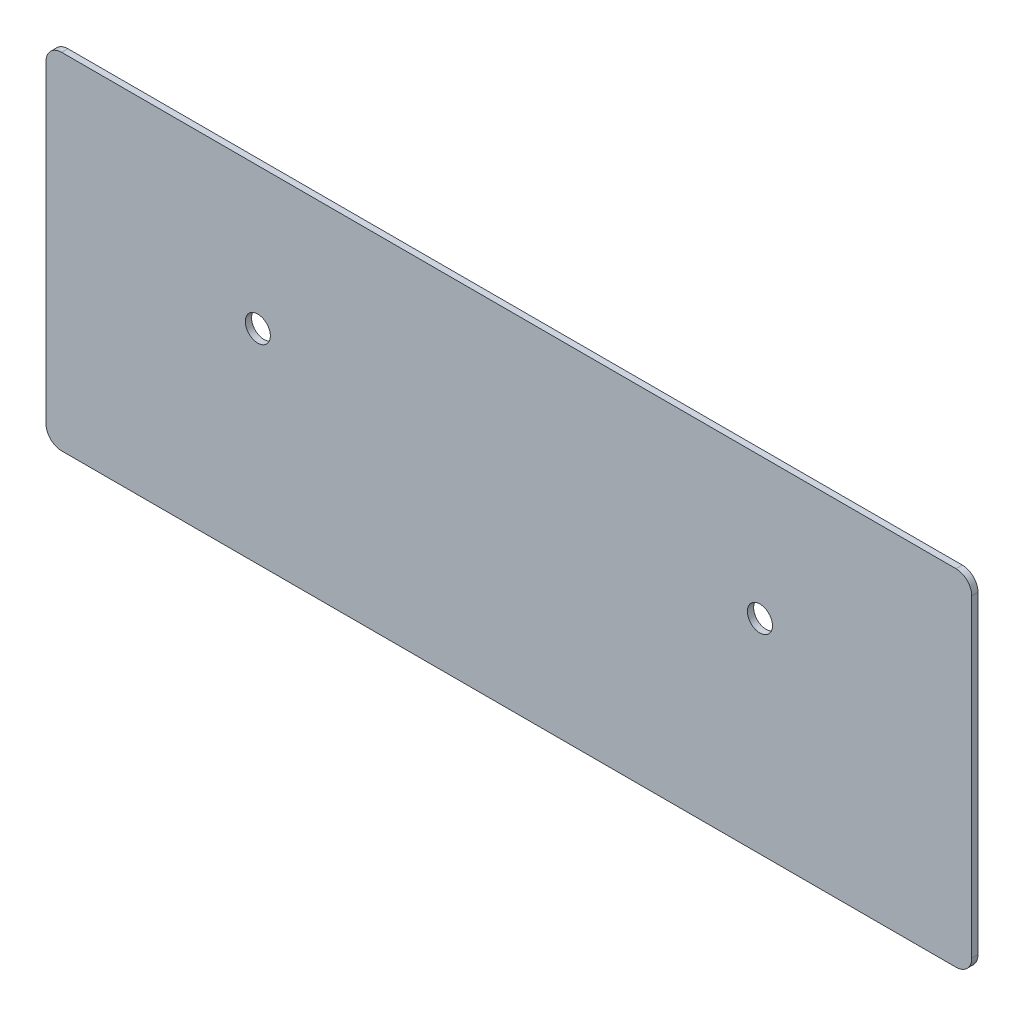
ISO-10303-21;
HEADER;
FILE_DESCRIPTION(('STEP AP214'),'2;1');
FILE_NAME('part.step','',(''),(''),'','','');
FILE_SCHEMA(('AUTOMOTIVE_DESIGN { 1 0 10303 214 1 1 1 1 }'));
ENDSEC;
DATA;
#1=APPLICATION_CONTEXT('core data for automotive mechanical design processes');
#2=APPLICATION_PROTOCOL_DEFINITION('international standard','automotive_design',2000,#1);
#3=PRODUCT_CONTEXT('',#1,'mechanical');
#4=PRODUCT('Part','Part','',(#3));
#5=PRODUCT_RELATED_PRODUCT_CATEGORY('part','',(#4));
#6=PRODUCT_DEFINITION_FORMATION('','',#4);
#7=PRODUCT_DEFINITION_CONTEXT('part definition',#1,'design');
#8=PRODUCT_DEFINITION('design','',#6,#7);
#9=PRODUCT_DEFINITION_SHAPE('','',#8);
#10=(LENGTH_UNIT() NAMED_UNIT(*) SI_UNIT(.MILLI.,.METRE.));
#11=(NAMED_UNIT(*) PLANE_ANGLE_UNIT() SI_UNIT($,.RADIAN.));
#12=(NAMED_UNIT(*) SI_UNIT($,.STERADIAN.) SOLID_ANGLE_UNIT());
#13=UNCERTAINTY_MEASURE_WITH_UNIT(LENGTH_MEASURE(1.E-05),#10,'distance_accuracy_value','');
#14=(GEOMETRIC_REPRESENTATION_CONTEXT(3) GLOBAL_UNCERTAINTY_ASSIGNED_CONTEXT((#13)) GLOBAL_UNIT_ASSIGNED_CONTEXT((#10,
#11,#12)) REPRESENTATION_CONTEXT('',''));
#15=CARTESIAN_POINT('',(0.,0.,0.));
#16=DIRECTION('',(0.,0.,1.));
#17=DIRECTION('',(1.,0.,0.));
#18=AXIS2_PLACEMENT_3D('',#15,#16,#17);
#19=CARTESIAN_POINT('',(-147.5,55.,0.));
#20=DIRECTION('',(0.,-1.,0.));
#21=DIRECTION('',(-1.,0.,0.));
#22=AXIS2_PLACEMENT_3D('',#19,#20,#21);
#23=PLANE('',#22);
#24=DIRECTION('',(0.,0.,1.));
#25=VECTOR('',#24,1.);
#26=CARTESIAN_POINT('',(142.5,55.,0.));
#27=LINE('',#26,#25);
#28=CARTESIAN_POINT('',(142.5,55.,-2.));
#29=VERTEX_POINT('',#28);
#30=CARTESIAN_POINT('',(142.5,55.,0.));
#31=VERTEX_POINT('',#30);
#32=EDGE_CURVE('E11',#29,#31,#27,.T.);
#33=ORIENTED_EDGE('',*,*,#32,.F.);
#34=DIRECTION('',(-1.,0.,0.));
#35=VECTOR('',#34,1.);
#36=CARTESIAN_POINT('',(0.,55.,-2.));
#37=LINE('',#36,#35);
#38=CARTESIAN_POINT('',(-142.5,55.,-2.));
#39=VERTEX_POINT('',#38);
#40=EDGE_CURVE('E106',#29,#39,#37,.T.);
#41=ORIENTED_EDGE('',*,*,#40,.T.);
#42=DIRECTION('',(0.,0.,1.));
#43=VECTOR('',#42,1.);
#44=CARTESIAN_POINT('',(-142.5,55.,0.));
#45=LINE('',#44,#43);
#46=CARTESIAN_POINT('',(-142.5,55.,0.));
#47=VERTEX_POINT('',#46);
#48=EDGE_CURVE('E49',#39,#47,#45,.T.);
#49=ORIENTED_EDGE('',*,*,#48,.T.);
#50=DIRECTION('',(-1.,0.,0.));
#51=VECTOR('',#50,1.);
#52=CARTESIAN_POINT('',(-147.5,55.,0.));
#53=LINE('',#52,#51);
#54=EDGE_CURVE('E148',#31,#47,#53,.T.);
#55=ORIENTED_EDGE('',*,*,#54,.F.);
#56=EDGE_LOOP('',(#33,#41,#49,#55));
#57=FACE_BOUND('',#56,.T.);
#58=ADVANCED_FACE('F39',(#57),#23,.F.);
#59=CARTESIAN_POINT('',(-142.5,50.,0.));
#60=DIRECTION('',(0.,0.,-1.));
#61=DIRECTION('',(-1.,0.,0.));
#62=AXIS2_PLACEMENT_3D('',#59,#60,#61);
#63=CYLINDRICAL_SURFACE('',#62,5.);
#64=ORIENTED_EDGE('',*,*,#48,.F.);
#65=CARTESIAN_POINT('',(-142.5,50.,-2.));
#66=DIRECTION('',(0.,0.,-1.));
#67=DIRECTION('',(-1.,0.,0.));
#68=AXIS2_PLACEMENT_3D('',#65,#66,#67);
#69=CIRCLE('',#68,5.);
#70=CARTESIAN_POINT('',(-147.5,50.,-2.));
#71=VERTEX_POINT('',#70);
#72=EDGE_CURVE('E128',#39,#71,#69,.F.);
#73=ORIENTED_EDGE('',*,*,#72,.T.);
#74=DIRECTION('',(0.,0.,1.));
#75=VECTOR('',#74,1.);
#76=CARTESIAN_POINT('',(-147.5,50.,0.));
#77=LINE('',#76,#75);
#78=CARTESIAN_POINT('',(-147.5,50.,0.));
#79=VERTEX_POINT('',#78);
#80=EDGE_CURVE('E141',#71,#79,#77,.T.);
#81=ORIENTED_EDGE('',*,*,#80,.T.);
#82=CARTESIAN_POINT('',(-142.5,50.,0.));
#83=DIRECTION('',(0.,0.,-1.));
#84=DIRECTION('',(-1.,0.,0.));
#85=AXIS2_PLACEMENT_3D('',#82,#83,#84);
#86=CIRCLE('',#85,5.);
#87=EDGE_CURVE('E157',#47,#79,#86,.F.);
#88=ORIENTED_EDGE('',*,*,#87,.F.);
#89=EDGE_LOOP('',(#64,#73,#81,#88));
#90=FACE_BOUND('',#89,.T.);
#91=ADVANCED_FACE('F160',(#90),#63,.T.);
#92=CARTESIAN_POINT('',(-147.5,-55.,0.));
#93=DIRECTION('',(1.,0.,0.));
#94=DIRECTION('',(0.,-1.,0.));
#95=AXIS2_PLACEMENT_3D('',#92,#93,#94);
#96=PLANE('',#95);
#97=ORIENTED_EDGE('',*,*,#80,.F.);
#98=DIRECTION('',(0.,1.,0.));
#99=VECTOR('',#98,1.);
#100=CARTESIAN_POINT('',(-147.5,0.,-2.));
#101=LINE('',#100,#99);
#102=CARTESIAN_POINT('',(-147.5,-50.,-2.));
#103=VERTEX_POINT('',#102);
#104=EDGE_CURVE('E125',#71,#103,#101,.F.);
#105=ORIENTED_EDGE('',*,*,#104,.T.);
#106=DIRECTION('',(0.,0.,1.));
#107=VECTOR('',#106,1.);
#108=CARTESIAN_POINT('',(-147.5,-50.,0.));
#109=LINE('',#108,#107);
#110=CARTESIAN_POINT('',(-147.5,-50.,0.));
#111=VERTEX_POINT('',#110);
#112=EDGE_CURVE('E138',#103,#111,#109,.T.);
#113=ORIENTED_EDGE('',*,*,#112,.T.);
#114=DIRECTION('',(0.,-1.,0.));
#115=VECTOR('',#114,1.);
#116=CARTESIAN_POINT('',(-147.5,-55.,0.));
#117=LINE('',#116,#115);
#118=EDGE_CURVE('E161',#79,#111,#117,.T.);
#119=ORIENTED_EDGE('',*,*,#118,.F.);
#120=EDGE_LOOP('',(#97,#105,#113,#119));
#121=FACE_BOUND('',#120,.T.);
#122=ADVANCED_FACE('F199',(#121),#96,.F.);
#123=CARTESIAN_POINT('',(-142.5,-50.,0.));
#124=DIRECTION('',(0.,0.,-1.));
#125=DIRECTION('',(-1.,0.,0.));
#126=AXIS2_PLACEMENT_3D('',#123,#124,#125);
#127=CYLINDRICAL_SURFACE('',#126,5.);
#128=ORIENTED_EDGE('',*,*,#112,.F.);
#129=CARTESIAN_POINT('',(-142.5,-50.,-2.));
#130=DIRECTION('',(0.,0.,-1.));
#131=DIRECTION('',(-1.,0.,0.));
#132=AXIS2_PLACEMENT_3D('',#129,#130,#131);
#133=CIRCLE('',#132,5.);
#134=CARTESIAN_POINT('',(-142.5,-55.,-2.));
#135=VERTEX_POINT('',#134);
#136=EDGE_CURVE('E122',#103,#135,#133,.F.);
#137=ORIENTED_EDGE('',*,*,#136,.T.);
#138=DIRECTION('',(0.,0.,1.));
#139=VECTOR('',#138,1.);
#140=CARTESIAN_POINT('',(-142.5,-55.,0.));
#141=LINE('',#140,#139);
#142=CARTESIAN_POINT('',(-142.5,-55.,0.));
#143=VERTEX_POINT('',#142);
#144=EDGE_CURVE('E135',#135,#143,#141,.T.);
#145=ORIENTED_EDGE('',*,*,#144,.T.);
#146=CARTESIAN_POINT('',(-142.5,-50.,0.));
#147=DIRECTION('',(0.,0.,-1.));
#148=DIRECTION('',(-1.,0.,0.));
#149=AXIS2_PLACEMENT_3D('',#146,#147,#148);
#150=CIRCLE('',#149,5.);
#151=EDGE_CURVE('E163',#111,#143,#150,.F.);
#152=ORIENTED_EDGE('',*,*,#151,.F.);
#153=EDGE_LOOP('',(#128,#137,#145,#152));
#154=FACE_BOUND('',#153,.T.);
#155=ADVANCED_FACE('F204',(#154),#127,.T.);
#156=CARTESIAN_POINT('',(-147.5,-55.,0.));
#157=DIRECTION('',(0.,1.,0.));
#158=DIRECTION('',(1.,0.,0.));
#159=AXIS2_PLACEMENT_3D('',#156,#157,#158);
#160=PLANE('',#159);
#161=ORIENTED_EDGE('',*,*,#144,.F.);
#162=DIRECTION('',(-1.,0.,0.));
#163=VECTOR('',#162,1.);
#164=CARTESIAN_POINT('',(0.,-55.,-2.));
#165=LINE('',#164,#163);
#166=CARTESIAN_POINT('',(142.5,-55.,-2.));
#167=VERTEX_POINT('',#166);
#168=EDGE_CURVE('E119',#135,#167,#165,.F.);
#169=ORIENTED_EDGE('',*,*,#168,.T.);
#170=DIRECTION('',(0.,0.,1.));
#171=VECTOR('',#170,1.);
#172=CARTESIAN_POINT('',(142.5,-55.,0.));
#173=LINE('',#172,#171);
#174=CARTESIAN_POINT('',(142.5,-55.,0.));
#175=VERTEX_POINT('',#174);
#176=EDGE_CURVE('E133',#167,#175,#173,.T.);
#177=ORIENTED_EDGE('',*,*,#176,.T.);
#178=DIRECTION('',(1.,0.,0.));
#179=VECTOR('',#178,1.);
#180=CARTESIAN_POINT('',(-147.5,-55.,0.));
#181=LINE('',#180,#179);
#182=EDGE_CURVE('E169',#143,#175,#181,.T.);
#183=ORIENTED_EDGE('',*,*,#182,.F.);
#184=EDGE_LOOP('',(#161,#169,#177,#183));
#185=FACE_BOUND('',#184,.T.);
#186=ADVANCED_FACE('F208',(#185),#160,.F.);
#187=CARTESIAN_POINT('',(142.5,-50.,0.));
#188=DIRECTION('',(0.,0.,-1.));
#189=DIRECTION('',(-1.,0.,0.));
#190=AXIS2_PLACEMENT_3D('',#187,#188,#189);
#191=CYLINDRICAL_SURFACE('',#190,5.);
#192=ORIENTED_EDGE('',*,*,#176,.F.);
#193=CARTESIAN_POINT('',(142.5,-50.,-2.));
#194=DIRECTION('',(0.,0.,-1.));
#195=DIRECTION('',(-1.,0.,0.));
#196=AXIS2_PLACEMENT_3D('',#193,#194,#195);
#197=CIRCLE('',#196,5.);
#198=CARTESIAN_POINT('',(147.5,-50.,-2.));
#199=VERTEX_POINT('',#198);
#200=EDGE_CURVE('E116',#167,#199,#197,.F.);
#201=ORIENTED_EDGE('',*,*,#200,.T.);
#202=DIRECTION('',(0.,0.,1.));
#203=VECTOR('',#202,1.);
#204=CARTESIAN_POINT('',(147.5,-50.,0.));
#205=LINE('',#204,#203);
#206=CARTESIAN_POINT('',(147.5,-50.,0.));
#207=VERTEX_POINT('',#206);
#208=EDGE_CURVE('E57',#199,#207,#205,.T.);
#209=ORIENTED_EDGE('',*,*,#208,.T.);
#210=CARTESIAN_POINT('',(142.5,-50.,0.));
#211=DIRECTION('',(0.,0.,-1.));
#212=DIRECTION('',(-1.,0.,0.));
#213=AXIS2_PLACEMENT_3D('',#210,#211,#212);
#214=CIRCLE('',#213,5.);
#215=EDGE_CURVE('E99',#175,#207,#214,.F.);
#216=ORIENTED_EDGE('',*,*,#215,.F.);
#217=EDGE_LOOP('',(#192,#201,#209,#216));
#218=FACE_BOUND('',#217,.T.);
#219=ADVANCED_FACE('F212',(#218),#191,.T.);
#220=CARTESIAN_POINT('',(147.5,-55.,0.));
#221=DIRECTION('',(-1.,0.,0.));
#222=DIRECTION('',(0.,1.,0.));
#223=AXIS2_PLACEMENT_3D('',#220,#221,#222);
#224=PLANE('',#223);
#225=ORIENTED_EDGE('',*,*,#208,.F.);
#226=DIRECTION('',(0.,1.,0.));
#227=VECTOR('',#226,1.);
#228=CARTESIAN_POINT('',(147.5,0.,-2.));
#229=LINE('',#228,#227);
#230=CARTESIAN_POINT('',(147.5,50.,-2.));
#231=VERTEX_POINT('',#230);
#232=EDGE_CURVE('E104',#199,#231,#229,.T.);
#233=ORIENTED_EDGE('',*,*,#232,.T.);
#234=DIRECTION('',(0.,0.,1.));
#235=VECTOR('',#234,1.);
#236=CARTESIAN_POINT('',(147.5,50.,0.));
#237=LINE('',#236,#235);
#238=CARTESIAN_POINT('',(147.5,50.,0.));
#239=VERTEX_POINT('',#238);
#240=EDGE_CURVE('E43',#231,#239,#237,.T.);
#241=ORIENTED_EDGE('',*,*,#240,.T.);
#242=DIRECTION('',(0.,1.,0.));
#243=VECTOR('',#242,1.);
#244=CARTESIAN_POINT('',(147.5,-55.,0.));
#245=LINE('',#244,#243);
#246=EDGE_CURVE('E346',#207,#239,#245,.T.);
#247=ORIENTED_EDGE('',*,*,#246,.F.);
#248=EDGE_LOOP('',(#225,#233,#241,#247));
#249=FACE_BOUND('',#248,.T.);
#250=ADVANCED_FACE('F108',(#249),#224,.F.);
#251=CARTESIAN_POINT('',(80.,10.,0.));
#252=DIRECTION('',(0.,0.,-1.));
#253=DIRECTION('',(-1.,0.,0.));
#254=AXIS2_PLACEMENT_3D('',#251,#252,#253);
#255=CYLINDRICAL_SURFACE('',#254,4.);
#256=CARTESIAN_POINT('',(80.,10.,0.));
#257=DIRECTION('',(0.,0.,-1.));
#258=DIRECTION('',(-1.,0.,0.));
#259=AXIS2_PLACEMENT_3D('',#256,#257,#258);
#260=CIRCLE('',#259,4.);
#261=CARTESIAN_POINT('',(76.,10.,0.));
#262=VERTEX_POINT('',#261);
#263=EDGE_CURVE('E118',#262,#262,#260,.T.);
#264=ORIENTED_EDGE('',*,*,#263,.F.);
#265=EDGE_LOOP('',(#264));
#266=FACE_BOUND('',#265,.T.);
#267=CARTESIAN_POINT('',(80.,10.,-2.));
#268=DIRECTION('',(0.,0.,-1.));
#269=DIRECTION('',(-1.,0.,0.));
#270=AXIS2_PLACEMENT_3D('',#267,#268,#269);
#271=CIRCLE('',#270,4.);
#272=CARTESIAN_POINT('',(76.,10.,-2.));
#273=VERTEX_POINT('',#272);
#274=EDGE_CURVE('E112',#273,#273,#271,.T.);
#275=ORIENTED_EDGE('',*,*,#274,.T.);
#276=EDGE_LOOP('',(#275));
#277=FACE_BOUND('',#276,.T.);
#278=ADVANCED_FACE('F176',(#266,#277),#255,.F.);
#279=CARTESIAN_POINT('',(-80.,9.99999999999999,0.));
#280=DIRECTION('',(0.,0.,-1.));
#281=DIRECTION('',(-1.,0.,0.));
#282=AXIS2_PLACEMENT_3D('',#279,#280,#281);
#283=CYLINDRICAL_SURFACE('',#282,4.);
#284=CARTESIAN_POINT('',(-80.,9.99999999999999,0.));
#285=DIRECTION('',(0.,0.,-1.));
#286=DIRECTION('',(-1.,0.,0.));
#287=AXIS2_PLACEMENT_3D('',#284,#285,#286);
#288=CIRCLE('',#287,4.);
#289=CARTESIAN_POINT('',(-84.,9.99999999999999,0.));
#290=VERTEX_POINT('',#289);
#291=EDGE_CURVE('E345',#290,#290,#288,.T.);
#292=ORIENTED_EDGE('',*,*,#291,.F.);
#293=EDGE_LOOP('',(#292));
#294=FACE_BOUND('',#293,.T.);
#295=CARTESIAN_POINT('',(-80.,9.99999999999999,-2.));
#296=DIRECTION('',(0.,0.,-1.));
#297=DIRECTION('',(-1.,0.,0.));
#298=AXIS2_PLACEMENT_3D('',#295,#296,#297);
#299=CIRCLE('',#298,4.);
#300=CARTESIAN_POINT('',(-84.,9.99999999999999,-2.));
#301=VERTEX_POINT('',#300);
#302=EDGE_CURVE('E109',#301,#301,#299,.T.);
#303=ORIENTED_EDGE('',*,*,#302,.T.);
#304=EDGE_LOOP('',(#303));
#305=FACE_BOUND('',#304,.T.);
#306=ADVANCED_FACE('F183',(#294,#305),#283,.F.);
#307=CARTESIAN_POINT('',(142.5,50.,0.));
#308=DIRECTION('',(0.,0.,-1.));
#309=DIRECTION('',(-1.,0.,0.));
#310=AXIS2_PLACEMENT_3D('',#307,#308,#309);
#311=CYLINDRICAL_SURFACE('',#310,5.);
#312=CARTESIAN_POINT('',(142.5,50.,-2.));
#313=DIRECTION('',(0.,0.,-1.));
#314=DIRECTION('',(-1.,0.,0.));
#315=AXIS2_PLACEMENT_3D('',#312,#313,#314);
#316=CIRCLE('',#315,5.);
#317=EDGE_CURVE('E93',#231,#29,#316,.F.);
#318=ORIENTED_EDGE('',*,*,#317,.T.);
#319=ORIENTED_EDGE('',*,*,#32,.T.);
#320=CARTESIAN_POINT('',(142.5,50.,0.));
#321=DIRECTION('',(0.,0.,-1.));
#322=DIRECTION('',(-1.,0.,0.));
#323=AXIS2_PLACEMENT_3D('',#320,#321,#322);
#324=CIRCLE('',#323,5.);
#325=EDGE_CURVE('E95',#239,#31,#324,.F.);
#326=ORIENTED_EDGE('',*,*,#325,.F.);
#327=ORIENTED_EDGE('',*,*,#240,.F.);
#328=EDGE_LOOP('',(#318,#319,#326,#327));
#329=FACE_BOUND('',#328,.T.);
#330=ADVANCED_FACE('F41',(#329),#311,.T.);
#331=CARTESIAN_POINT('',(0.,0.,0.));
#332=DIRECTION('',(0.,0.,-1.));
#333=DIRECTION('',(-1.,0.,0.));
#334=AXIS2_PLACEMENT_3D('',#331,#332,#333);
#335=PLANE('',#334);
#336=ORIENTED_EDGE('',*,*,#263,.T.);
#337=EDGE_LOOP('',(#336));
#338=FACE_BOUND('',#337,.T.);
#339=ORIENTED_EDGE('',*,*,#291,.T.);
#340=EDGE_LOOP('',(#339));
#341=FACE_BOUND('',#340,.T.);
#342=ORIENTED_EDGE('',*,*,#246,.T.);
#343=ORIENTED_EDGE('',*,*,#325,.T.);
#344=ORIENTED_EDGE('',*,*,#54,.T.);
#345=ORIENTED_EDGE('',*,*,#87,.T.);
#346=ORIENTED_EDGE('',*,*,#118,.T.);
#347=ORIENTED_EDGE('',*,*,#151,.T.);
#348=ORIENTED_EDGE('',*,*,#182,.T.);
#349=ORIENTED_EDGE('',*,*,#215,.T.);
#350=EDGE_LOOP('',(#342,#343,#344,#345,#346,#347,#348,#349));
#351=FACE_BOUND('',#350,.T.);
#352=ADVANCED_FACE('F155',(#338,#341,#351),#335,.F.);
#353=CARTESIAN_POINT('',(0.,0.,-2.));
#354=DIRECTION('',(0.,0.,-1.));
#355=DIRECTION('',(-1.,0.,0.));
#356=AXIS2_PLACEMENT_3D('',#353,#354,#355);
#357=PLANE('',#356);
#358=ORIENTED_EDGE('',*,*,#274,.F.);
#359=EDGE_LOOP('',(#358));
#360=FACE_BOUND('',#359,.T.);
#361=ORIENTED_EDGE('',*,*,#302,.F.);
#362=EDGE_LOOP('',(#361));
#363=FACE_BOUND('',#362,.T.);
#364=ORIENTED_EDGE('',*,*,#232,.F.);
#365=ORIENTED_EDGE('',*,*,#200,.F.);
#366=ORIENTED_EDGE('',*,*,#168,.F.);
#367=ORIENTED_EDGE('',*,*,#136,.F.);
#368=ORIENTED_EDGE('',*,*,#104,.F.);
#369=ORIENTED_EDGE('',*,*,#72,.F.);
#370=ORIENTED_EDGE('',*,*,#40,.F.);
#371=ORIENTED_EDGE('',*,*,#317,.F.);
#372=EDGE_LOOP('',(#364,#365,#366,#367,#368,#369,#370,#371));
#373=FACE_BOUND('',#372,.T.);
#374=ADVANCED_FACE('F102',(#360,#363,#373),#357,.T.);
#375=CLOSED_SHELL('',(#58,#91,#122,#155,#186,#219,#250,#278,#306,#330,#352,#374));
#376=MANIFOLD_SOLID_BREP('B2',#375);
#377=ADVANCED_BREP_SHAPE_REPRESENTATION('',(#18,#376),#14);
#378=SHAPE_DEFINITION_REPRESENTATION(#9,#377);
ENDSEC;
END-ISO-10303-21;
